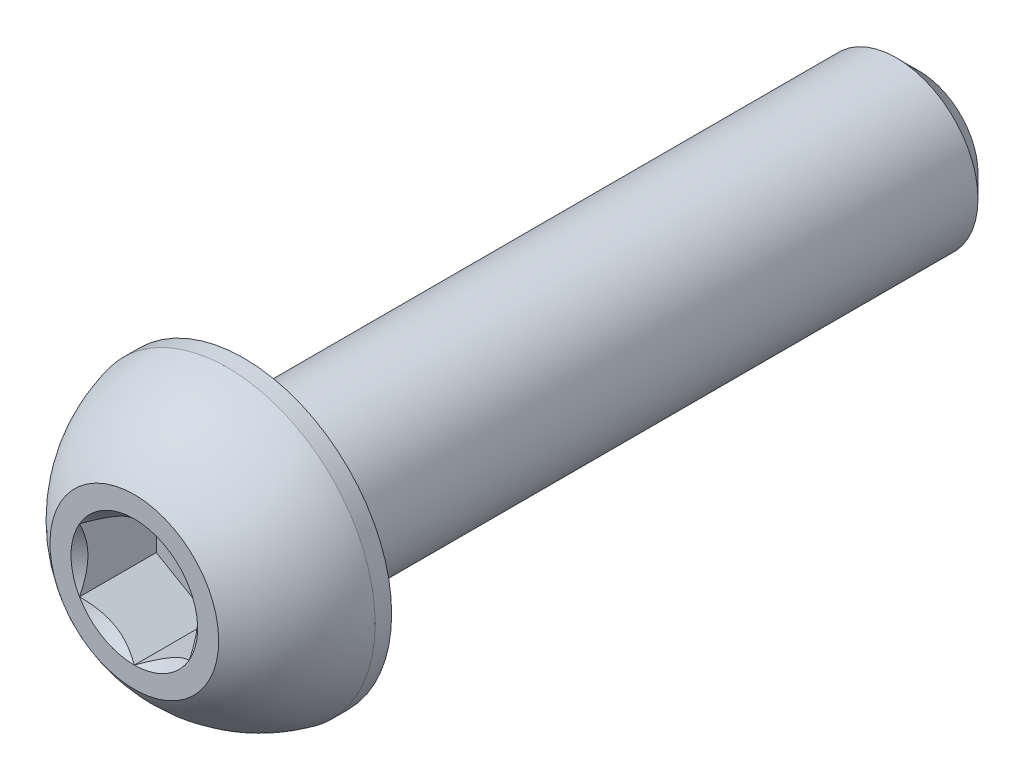
ISO-10303-21;
HEADER;
FILE_DESCRIPTION(('STEP AP214'),'2;1');
FILE_NAME('part.step','',(''),(''),'','','');
FILE_SCHEMA(('AUTOMOTIVE_DESIGN { 1 0 10303 214 1 1 1 1 }'));
ENDSEC;
DATA;
#1=APPLICATION_CONTEXT('core data for automotive mechanical design processes');
#2=APPLICATION_PROTOCOL_DEFINITION('international standard','automotive_design',2000,#1);
#3=PRODUCT_CONTEXT('',#1,'mechanical');
#4=PRODUCT('Part','Part','',(#3));
#5=PRODUCT_RELATED_PRODUCT_CATEGORY('part','',(#4));
#6=PRODUCT_DEFINITION_FORMATION('','',#4);
#7=PRODUCT_DEFINITION_CONTEXT('part definition',#1,'design');
#8=PRODUCT_DEFINITION('design','',#6,#7);
#9=PRODUCT_DEFINITION_SHAPE('','',#8);
#10=(LENGTH_UNIT() NAMED_UNIT(*) SI_UNIT(.MILLI.,.METRE.));
#11=(NAMED_UNIT(*) PLANE_ANGLE_UNIT() SI_UNIT($,.RADIAN.));
#12=(NAMED_UNIT(*) SI_UNIT($,.STERADIAN.) SOLID_ANGLE_UNIT());
#13=UNCERTAINTY_MEASURE_WITH_UNIT(LENGTH_MEASURE(1.E-05),#10,'distance_accuracy_value','');
#14=(GEOMETRIC_REPRESENTATION_CONTEXT(3) GLOBAL_UNCERTAINTY_ASSIGNED_CONTEXT((#13)) GLOBAL_UNIT_ASSIGNED_CONTEXT((#10,
#11,#12)) REPRESENTATION_CONTEXT('',''));
#15=CARTESIAN_POINT('',(0.,0.,0.));
#16=DIRECTION('',(0.,0.,1.));
#17=DIRECTION('',(1.,0.,0.));
#18=AXIS2_PLACEMENT_3D('',#15,#16,#17);
#19=CARTESIAN_POINT('',(0.650000000000001,-0.375277674973256,-0.91));
#20=DIRECTION('',(0.,0.,1.));
#21=DIRECTION('',(1.,0.,0.));
#22=AXIS2_PLACEMENT_3D('',#19,#20,#21);
#23=PLANE('',#22);
#24=DIRECTION('',(0.,1.,0.));
#25=VECTOR('',#24,1.);
#26=CARTESIAN_POINT('',(-0.650000000000001,0.375277674973256,-0.91));
#27=LINE('',#26,#25);
#28=CARTESIAN_POINT('',(-0.650000000000001,0.375277674973256,-0.91));
#29=VERTEX_POINT('',#28);
#30=CARTESIAN_POINT('',(-0.650000000000001,-0.375277674973256,-0.91));
#31=VERTEX_POINT('',#30);
#32=EDGE_CURVE('E67',#29,#31,#27,.F.);
#33=ORIENTED_EDGE('',*,*,#32,.T.);
#34=DIRECTION('',(0.866025403784439,-0.5,0.));
#35=VECTOR('',#34,1.);
#36=CARTESIAN_POINT('',(-0.650000000000001,-0.375277674973256,-0.91));
#37=LINE('',#36,#35);
#38=CARTESIAN_POINT('',(0.,-0.750555349946514,-0.91));
#39=VERTEX_POINT('',#38);
#40=EDGE_CURVE('E81',#31,#39,#37,.T.);
#41=ORIENTED_EDGE('',*,*,#40,.T.);
#42=DIRECTION('',(0.866025403784438,0.5,0.));
#43=VECTOR('',#42,1.);
#44=CARTESIAN_POINT('',(0.,-0.750555349946514,-0.91));
#45=LINE('',#44,#43);
#46=CARTESIAN_POINT('',(0.650000000000001,-0.375277674973256,-0.91));
#47=VERTEX_POINT('',#46);
#48=EDGE_CURVE('E84',#39,#47,#45,.T.);
#49=ORIENTED_EDGE('',*,*,#48,.T.);
#50=DIRECTION('',(0.,1.,0.));
#51=VECTOR('',#50,1.);
#52=CARTESIAN_POINT('',(0.650000000000001,-0.375277674973256,-0.91));
#53=LINE('',#52,#51);
#54=CARTESIAN_POINT('',(0.650000000000001,0.375277674973256,-0.91));
#55=VERTEX_POINT('',#54);
#56=EDGE_CURVE('E93',#47,#55,#53,.T.);
#57=ORIENTED_EDGE('',*,*,#56,.T.);
#58=DIRECTION('',(-0.866025403784439,0.5,0.));
#59=VECTOR('',#58,1.);
#60=CARTESIAN_POINT('',(0.650000000000001,0.375277674973256,-0.91));
#61=LINE('',#60,#59);
#62=CARTESIAN_POINT('',(0.,0.750555349946514,-0.91));
#63=VERTEX_POINT('',#62);
#64=EDGE_CURVE('E263',#55,#63,#61,.T.);
#65=ORIENTED_EDGE('',*,*,#64,.T.);
#66=DIRECTION('',(-0.866025403784439,-0.5,0.));
#67=VECTOR('',#66,1.);
#68=CARTESIAN_POINT('',(0.,0.750555349946514,-0.91));
#69=LINE('',#68,#67);
#70=EDGE_CURVE('E72',#63,#29,#69,.T.);
#71=ORIENTED_EDGE('',*,*,#70,.T.);
#72=EDGE_LOOP('',(#33,#41,#49,#57,#65,#71));
#73=FACE_BOUND('',#72,.T.);
#74=ADVANCED_FACE('F17',(#73),#23,.T.);
#75=CARTESIAN_POINT('',(-0.650000000000001,-0.375277674973256,-0.91));
#76=DIRECTION('',(-0.5,-0.866025403784439,0.));
#77=DIRECTION('',(0.866025403784439,-0.5,0.));
#78=AXIS2_PLACEMENT_3D('',#75,#76,#77);
#79=PLANE('',#78);
#80=CARTESIAN_POINT('',(-0.650000000003106,-0.375277674971463,-4.41290134901671E-12));
#81=CARTESIAN_POINT('',(-0.627658187702417,-0.38817672631745,-0.0128852768620479));
#82=CARTESIAN_POINT('',(-0.604944327314008,-0.401290579727033,-0.0250148378455423));
#83=CARTESIAN_POINT('',(-0.558628424322748,-0.428031078786798,-0.0472236226126969));
#84=CARTESIAN_POINT('',(-0.535021979420529,-0.441660266105704,-0.0572904939612144));
#85=CARTESIAN_POINT('',(-0.48741772651719,-0.469144594334018,-0.0745327488497148));
#86=CARTESIAN_POINT('',(-0.463432082445054,-0.482992712395752,-0.0817515019129221));
#87=CARTESIAN_POINT('',(-0.414944739657003,-0.510986892806723,-0.0928821716789931));
#88=CARTESIAN_POINT('',(-0.39044449165135,-0.525132117587999,-0.0968023651586737));
#89=CARTESIAN_POINT('',(-0.330580650036921,-0.559694522658815,-0.101776896993975));
#90=CARTESIAN_POINT('',(-0.295077141699638,-0.580192482754522,-0.100873323609411));
#91=CARTESIAN_POINT('',(-0.224814729639984,-0.620758505271075,-0.0915850975613979));
#92=CARTESIAN_POINT('',(-0.190057015060289,-0.640825881140078,-0.0831892925293545));
#93=CARTESIAN_POINT('',(-0.129055083802418,-0.676045362572897,-0.0629573906715305));
#94=CARTESIAN_POINT('',(-0.102528811277548,-0.691360313155728,-0.0521824020198646));
#95=CARTESIAN_POINT('',(-0.050514302718005,-0.721390903674346,-0.0279117157399621));
#96=CARTESIAN_POINT('',(-0.0250230041639314,-0.736108311756534,-0.0144248746778537));
#97=CARTESIAN_POINT('',(3.1059329908606E-12,-0.750555349948306,-4.41360538714369E-12));
#98=B_SPLINE_CURVE_WITH_KNOTS('',3,(#80,#81,#82,#83,#84,#85,#86,#87,#88,#89,#90,#91,#92,#93,#94,
#95,#96,#97),.UNSPECIFIED.,.F.,.F.,(4,2,2,2,2,2,2,2,4),(0.,0.086568915278292,0.173642001954796,
0.259332662432136,0.34480766041021,0.467047188351969,0.589468976870045,0.686740705134744,
0.783699770545585),.UNSPECIFIED.);
#99=CARTESIAN_POINT('',(-0.650000000002688,-0.375277674974807,-3.10290154336415E-12));
#100=VERTEX_POINT('',#99);
#101=CARTESIAN_POINT('',(-3.82135894395069E-12,-0.750555349950513,-2.20681226923395E-12));
#102=VERTEX_POINT('',#101);
#103=EDGE_CURVE('E20',#100,#102,#98,.T.);
#104=ORIENTED_EDGE('',*,*,#103,.T.);
#105=DIRECTION('',(0.,0.,1.));
#106=VECTOR('',#105,1.);
#107=CARTESIAN_POINT('',(0.,-0.750555349946514,-0.91));
#108=LINE('',#107,#106);
#109=EDGE_CURVE('E88',#102,#39,#108,.F.);
#110=ORIENTED_EDGE('',*,*,#109,.T.);
#111=ORIENTED_EDGE('',*,*,#40,.F.);
#112=DIRECTION('',(0.,0.,1.));
#113=VECTOR('',#112,1.);
#114=CARTESIAN_POINT('',(-0.650000000000001,-0.375277674973256,-0.91));
#115=LINE('',#114,#113);
#116=EDGE_CURVE('E59',#31,#100,#115,.T.);
#117=ORIENTED_EDGE('',*,*,#116,.T.);
#118=EDGE_LOOP('',(#104,#110,#111,#117));
#119=FACE_BOUND('',#118,.T.);
#120=ADVANCED_FACE('F89',(#119),#79,.F.);
#121=CARTESIAN_POINT('',(0.,-0.750555349946514,-0.91));
#122=DIRECTION('',(0.5,-0.866025403784438,0.));
#123=DIRECTION('',(0.866025403784438,0.5,0.));
#124=AXIS2_PLACEMENT_3D('',#121,#122,#123);
#125=PLANE('',#124);
#126=CARTESIAN_POINT('',(-3.10513434680188E-12,-0.750555349948307,-4.41302114699376E-12));
#127=CARTESIAN_POINT('',(0.0223418122975842,-0.737656298602319,-0.012885276862048));
#128=CARTESIAN_POINT('',(0.0450556726859926,-0.724542445192736,-0.0250148378455423));
#129=CARTESIAN_POINT('',(0.0913715756772533,-0.697801946132971,-0.0472236226126967));
#130=CARTESIAN_POINT('',(0.114978020579472,-0.684172758814065,-0.0572904939612141));
#131=CARTESIAN_POINT('',(0.162582273482811,-0.656688430585752,-0.0745327488497144));
#132=CARTESIAN_POINT('',(0.186567917554947,-0.642840312524017,-0.0817515019129215));
#133=CARTESIAN_POINT('',(0.235055260342998,-0.614846132113047,-0.0928821716789924));
#134=CARTESIAN_POINT('',(0.25955550834865,-0.60070090733177,-0.0968023651586729));
#135=CARTESIAN_POINT('',(0.319419349963079,-0.566138502260955,-0.101776896993974));
#136=CARTESIAN_POINT('',(0.354922858300362,-0.545640542165248,-0.100873323609411));
#137=CARTESIAN_POINT('',(0.425185270360016,-0.505074519648694,-0.0915850975613972));
#138=CARTESIAN_POINT('',(0.459942984939711,-0.485007143779691,-0.0831892925293537));
#139=CARTESIAN_POINT('',(0.520944916197582,-0.449787662346872,-0.0629573906715296));
#140=CARTESIAN_POINT('',(0.547471188722452,-0.434472711764042,-0.0521824020198637));
#141=CARTESIAN_POINT('',(0.599485697281995,-0.404442121245423,-0.0279117157399613));
#142=CARTESIAN_POINT('',(0.624976995836069,-0.389724713163235,-0.0144248746778528));
#143=CARTESIAN_POINT('',(0.650000000003106,-0.375277674971463,-4.41266400623362E-12));
#144=B_SPLINE_CURVE_WITH_KNOTS('',3,(#126,#127,#128,#129,#130,#131,#132,#133,#134,#135,#136,
#137,#138,#139,#140,#141,#142,#143),.UNSPECIFIED.,.F.,.F.,(4,2,2,2,2,2,2,2,4),(0.,
0.0865689152782918,0.173642001954795,0.259332662432135,0.344807660410208,0.467047188351967,
0.589468976870044,0.686740705134743,0.783699770545584),.UNSPECIFIED.);
#145=CARTESIAN_POINT('',(0.650000000001554,-0.375277674978565,-2.20630106907732E-12));
#146=VERTEX_POINT('',#145);
#147=EDGE_CURVE('E202',#102,#146,#144,.T.);
#148=ORIENTED_EDGE('',*,*,#147,.T.);
#149=DIRECTION('',(0.,0.,-1.));
#150=VECTOR('',#149,1.);
#151=CARTESIAN_POINT('',(0.650000000000001,-0.375277674973256,-0.91));
#152=LINE('',#151,#150);
#153=EDGE_CURVE('E97',#146,#47,#152,.T.);
#154=ORIENTED_EDGE('',*,*,#153,.T.);
#155=ORIENTED_EDGE('',*,*,#48,.F.);
#156=ORIENTED_EDGE('',*,*,#109,.F.);
#157=EDGE_LOOP('',(#148,#154,#155,#156));
#158=FACE_BOUND('',#157,.T.);
#159=ADVANCED_FACE('F95',(#158),#125,.F.);
#160=CARTESIAN_POINT('',(0.650000000000001,-0.375277674973256,-0.91));
#161=DIRECTION('',(1.,0.,0.));
#162=DIRECTION('',(0.,0.,-1.));
#163=AXIS2_PLACEMENT_3D('',#160,#161,#162);
#164=PLANE('',#163);
#165=CARTESIAN_POINT('',(0.650000000000001,-0.375277674976841,-4.4129866438153E-12));
#166=CARTESIAN_POINT('',(0.650000000000001,-0.349479572297389,-0.0128852768630225));
#167=CARTESIAN_POINT('',(0.650000000000001,-0.32325186549082,-0.0250148378480049));
#168=CARTESIAN_POINT('',(0.650000000000001,-0.269770867396475,-0.047223622619523));
#169=CARTESIAN_POINT('',(0.650000000000001,-0.242512492771248,-0.0572904939709195));
#170=CARTESIAN_POINT('',(0.650000000000001,-0.187543836339123,-0.0745327488668831));
#171=CARTESIAN_POINT('',(0.650000000000001,-0.159847600227568,-0.0817515019346237));
#172=CARTESIAN_POINT('',(0.650000000000001,-0.103859239428849,-0.0928821717113189));
#173=CARTESIAN_POINT('',(0.650000000000001,-0.0755687898776079,-0.0968023651970885));
#174=CARTESIAN_POINT('',(0.650000000000001,-0.006443979777503,-0.101776897047502));
#175=CARTESIAN_POINT('',(0.650000000000001,0.0345519403839369,-0.100873323675418));
#176=CARTESIAN_POINT('',(0.650000000000001,0.115683985359937,-0.0915850976572371));
#177=CARTESIAN_POINT('',(0.650000000000001,0.155818737070815,-0.0831892926425625));
#178=CARTESIAN_POINT('',(0.650000000000001,0.226257699967498,-0.0629573907945614));
#179=CARTESIAN_POINT('',(0.650000000000001,0.256887601188171,-0.0521824021260602));
#180=CARTESIAN_POINT('',(0.650000000000001,0.316948782330806,-0.027911715800576));
#181=CARTESIAN_POINT('',(0.650000000000001,0.346383598545568,-0.014424874709727));
#182=CARTESIAN_POINT('',(0.650000000000001,0.375277674976841,-4.41309680496693E-12));
#183=B_SPLINE_CURVE_WITH_KNOTS('',3,(#165,#166,#167,#168,#169,#170,#171,#172,#173,#174,#175,
#176,#177,#178,#179,#180,#181,#182),.UNSPECIFIED.,.F.,.F.,(4,2,2,2,2,2,2,2,4),(0.,
0.0865689152459494,0.173642001890102,0.259332662336391,0.344807660283437,0.467047188135298,
0.589468976563184,0.686740704999196,0.783699770581928),.UNSPECIFIED.);
#184=CARTESIAN_POINT('',(0.650000000005375,0.375277674971945,-2.20651526969784E-12));
#185=VERTEX_POINT('',#184);
#186=EDGE_CURVE('E184',#146,#185,#183,.T.);
#187=ORIENTED_EDGE('',*,*,#186,.T.);
#188=DIRECTION('',(0.,0.,1.));
#189=VECTOR('',#188,1.);
#190=CARTESIAN_POINT('',(0.650000000000001,0.375277674973256,-0.91));
#191=LINE('',#190,#189);
#192=EDGE_CURVE('E260',#185,#55,#191,.F.);
#193=ORIENTED_EDGE('',*,*,#192,.T.);
#194=ORIENTED_EDGE('',*,*,#56,.F.);
#195=ORIENTED_EDGE('',*,*,#153,.F.);
#196=EDGE_LOOP('',(#187,#193,#194,#195));
#197=FACE_BOUND('',#196,.T.);
#198=ADVANCED_FACE('F174',(#197),#164,.F.);
#199=CARTESIAN_POINT('',(0.650000000000001,0.375277674973256,-0.91));
#200=DIRECTION('',(0.5,0.866025403784439,0.));
#201=DIRECTION('',(-0.866025403784439,0.5,0.));
#202=AXIS2_PLACEMENT_3D('',#199,#200,#201);
#203=PLANE('',#202);
#204=CARTESIAN_POINT('',(0.650000000003106,0.375277674971463,-4.41299389541244E-12));
#205=CARTESIAN_POINT('',(0.627658187702417,0.38817672631745,-0.012885276862048));
#206=CARTESIAN_POINT('',(0.604944327314008,0.401290579727033,-0.0250148378455423));
#207=CARTESIAN_POINT('',(0.558628424322747,0.428031078786798,-0.047223622612697));
#208=CARTESIAN_POINT('',(0.535021979420529,0.441660266105704,-0.0572904939612145));
#209=CARTESIAN_POINT('',(0.487417726517189,0.469144594334018,-0.0745327488497149));
#210=CARTESIAN_POINT('',(0.463432082445053,0.482992712395752,-0.0817515019129221));
#211=CARTESIAN_POINT('',(0.414944739657002,0.510986892806723,-0.0928821716789931));
#212=CARTESIAN_POINT('',(0.390444491651349,0.525132117588,-0.0968023651586737));
#213=CARTESIAN_POINT('',(0.33058065003692,0.559694522658815,-0.101776896993975));
#214=CARTESIAN_POINT('',(0.295077141699637,0.580192482754522,-0.100873323609411));
#215=CARTESIAN_POINT('',(0.224814729639983,0.620758505271075,-0.0915850975613977));
#216=CARTESIAN_POINT('',(0.190057015060288,0.640825881140079,-0.0831892925293544));
#217=CARTESIAN_POINT('',(0.129055083802417,0.676045362572897,-0.0629573906715303));
#218=CARTESIAN_POINT('',(0.102528811277548,0.691360313155728,-0.0521824020198643));
#219=CARTESIAN_POINT('',(0.0505143027180048,0.721390903674346,-0.0279117157399618));
#220=CARTESIAN_POINT('',(0.0250230041639313,0.736108311756534,-0.0144248746778534));
#221=CARTESIAN_POINT('',(-3.10605534729751E-12,0.750555349948306,-4.41357997323327E-12));
#222=B_SPLINE_CURVE_WITH_KNOTS('',3,(#204,#205,#206,#207,#208,#209,#210,#211,#212,#213,#214,
#215,#216,#217,#218,#219,#220,#221),.UNSPECIFIED.,.F.,.F.,(4,2,2,2,2,2,2,2,4),(0.,
0.0865689152782922,0.173642001954796,0.259332662432137,0.34480766041021,0.467047188351969,
0.589468976870046,0.686740705134744,0.783699770545585),.UNSPECIFIED.);
#223=CARTESIAN_POINT('',(3.82133084754313E-12,0.750555349950513,-2.20676269446314E-12));
#224=VERTEX_POINT('',#223);
#225=EDGE_CURVE('E178',#185,#224,#222,.T.);
#226=ORIENTED_EDGE('',*,*,#225,.T.);
#227=DIRECTION('',(0.,0.,1.));
#228=VECTOR('',#227,1.);
#229=CARTESIAN_POINT('',(0.,0.750555349946514,-0.91));
#230=LINE('',#229,#228);
#231=EDGE_CURVE('E255',#224,#63,#230,.F.);
#232=ORIENTED_EDGE('',*,*,#231,.T.);
#233=ORIENTED_EDGE('',*,*,#64,.F.);
#234=ORIENTED_EDGE('',*,*,#192,.F.);
#235=EDGE_LOOP('',(#226,#232,#233,#234));
#236=FACE_BOUND('',#235,.T.);
#237=ADVANCED_FACE('F170',(#236),#203,.F.);
#238=CARTESIAN_POINT('',(0.,0.750555349946514,-0.91));
#239=DIRECTION('',(-0.5,0.866025403784439,0.));
#240=DIRECTION('',(-0.866025403784439,-0.5,0.));
#241=AXIS2_PLACEMENT_3D('',#238,#239,#240);
#242=PLANE('',#241);
#243=CARTESIAN_POINT('',(3.10493996163853E-12,0.750555349948307,-4.41306487472797E-12));
#244=CARTESIAN_POINT('',(-0.0223418122975843,0.73765629860232,-0.012885276862048));
#245=CARTESIAN_POINT('',(-0.0450556726859927,0.724542445192736,-0.0250148378455423));
#246=CARTESIAN_POINT('',(-0.0913715756772534,0.697801946132971,-0.0472236226126966));
#247=CARTESIAN_POINT('',(-0.114978020579472,0.684172758814065,-0.0572904939612139));
#248=CARTESIAN_POINT('',(-0.162582273482811,0.656688430585752,-0.0745327488497141));
#249=CARTESIAN_POINT('',(-0.186567917554947,0.642840312524018,-0.0817515019129213));
#250=CARTESIAN_POINT('',(-0.235055260342997,0.614846132113047,-0.0928821716789922));
#251=CARTESIAN_POINT('',(-0.25955550834865,0.600700907331771,-0.0968023651586728));
#252=CARTESIAN_POINT('',(-0.319419349963079,0.566138502260955,-0.101776896993974));
#253=CARTESIAN_POINT('',(-0.354922858300362,0.545640542165248,-0.10087332360941));
#254=CARTESIAN_POINT('',(-0.425185270360016,0.505074519648695,-0.0915850975613969));
#255=CARTESIAN_POINT('',(-0.459942984939711,0.485007143779692,-0.0831892925293534));
#256=CARTESIAN_POINT('',(-0.520944916197582,0.449787662346873,-0.0629573906715294));
#257=CARTESIAN_POINT('',(-0.547471188722452,0.434472711764042,-0.0521824020198635));
#258=CARTESIAN_POINT('',(-0.599485697281995,0.404442121245423,-0.027911715739961));
#259=CARTESIAN_POINT('',(-0.624976995836069,0.389724713163236,-0.0144248746778525));
#260=CARTESIAN_POINT('',(-0.650000000003106,0.375277674971464,-4.41234683703336E-12));
#261=B_SPLINE_CURVE_WITH_KNOTS('',3,(#243,#244,#245,#246,#247,#248,#249,#250,#251,#252,#253,
#254,#255,#256,#257,#258,#259,#260),.UNSPECIFIED.,.F.,.F.,(4,2,2,2,2,2,2,2,4),(0.,
0.0865689152782916,0.173642001954795,0.259332662432135,0.344807660410208,0.467047188351967,
0.589468976870043,0.686740705134742,0.783699770545583),.UNSPECIFIED.);
#262=CARTESIAN_POINT('',(-0.650000000001554,0.375277674978566,-2.20610640845908E-12));
#263=VERTEX_POINT('',#262);
#264=EDGE_CURVE('E40',#224,#263,#261,.T.);
#265=ORIENTED_EDGE('',*,*,#264,.T.);
#266=DIRECTION('',(0.,0.,1.));
#267=VECTOR('',#266,1.);
#268=CARTESIAN_POINT('',(-0.650000000000001,0.375277674973256,-0.91));
#269=LINE('',#268,#267);
#270=EDGE_CURVE('E248',#263,#29,#269,.F.);
#271=ORIENTED_EDGE('',*,*,#270,.T.);
#272=ORIENTED_EDGE('',*,*,#70,.F.);
#273=ORIENTED_EDGE('',*,*,#231,.F.);
#274=EDGE_LOOP('',(#265,#271,#272,#273));
#275=FACE_BOUND('',#274,.T.);
#276=ADVANCED_FACE('F163',(#275),#242,.F.);
#277=CARTESIAN_POINT('',(-0.650000000000001,0.375277674973256,-0.91));
#278=DIRECTION('',(-1.,0.,0.));
#279=DIRECTION('',(0.,0.,1.));
#280=AXIS2_PLACEMENT_3D('',#277,#278,#279);
#281=PLANE('',#280);
#282=CARTESIAN_POINT('',(-0.650000000000001,0.375277674976841,-4.41298182513897E-12));
#283=CARTESIAN_POINT('',(-0.650000000000001,0.349479572297389,-0.0128852768630225));
#284=CARTESIAN_POINT('',(-0.650000000000001,0.32325186549082,-0.0250148378480049));
#285=CARTESIAN_POINT('',(-0.650000000000001,0.269770867396475,-0.047223622619523));
#286=CARTESIAN_POINT('',(-0.650000000000001,0.242512492771248,-0.0572904939709195));
#287=CARTESIAN_POINT('',(-0.650000000000001,0.187543836339123,-0.0745327488668831));
#288=CARTESIAN_POINT('',(-0.650000000000001,0.159847600227568,-0.0817515019346237));
#289=CARTESIAN_POINT('',(-0.650000000000001,0.103859239428849,-0.0928821717113189));
#290=CARTESIAN_POINT('',(-0.650000000000001,0.075568789877608,-0.0968023651970885));
#291=CARTESIAN_POINT('',(-0.650000000000001,0.00644397977750309,-0.101776897047502));
#292=CARTESIAN_POINT('',(-0.650000000000001,-0.0345519403839369,-0.100873323675418));
#293=CARTESIAN_POINT('',(-0.650000000000001,-0.115683985359937,-0.0915850976572371));
#294=CARTESIAN_POINT('',(-0.650000000000001,-0.155818737070815,-0.0831892926425626));
#295=CARTESIAN_POINT('',(-0.650000000000001,-0.226257699967498,-0.0629573907945614));
#296=CARTESIAN_POINT('',(-0.650000000000001,-0.256887601188171,-0.0521824021260602));
#297=CARTESIAN_POINT('',(-0.650000000000001,-0.316948782330805,-0.027911715800576));
#298=CARTESIAN_POINT('',(-0.650000000000001,-0.346383598545568,-0.014424874709727));
#299=CARTESIAN_POINT('',(-0.650000000000001,-0.375277674976841,-4.41309680496692E-12));
#300=B_SPLINE_CURVE_WITH_KNOTS('',3,(#282,#283,#284,#285,#286,#287,#288,#289,#290,#291,#292,
#293,#294,#295,#296,#297,#298,#299),.UNSPECIFIED.,.F.,.F.,(4,2,2,2,2,2,2,2,4),(0.,
0.0865689152459495,0.173642001890102,0.259332662336391,0.344807660283437,0.467047188135298,
0.589468976563184,0.686740704999196,0.783699770581928),.UNSPECIFIED.);
#301=EDGE_CURVE('E143',#263,#100,#300,.T.);
#302=ORIENTED_EDGE('',*,*,#301,.T.);
#303=ORIENTED_EDGE('',*,*,#116,.F.);
#304=ORIENTED_EDGE('',*,*,#32,.F.);
#305=ORIENTED_EDGE('',*,*,#270,.F.);
#306=EDGE_LOOP('',(#302,#303,#304,#305));
#307=FACE_BOUND('',#306,.T.);
#308=ADVANCED_FACE('F159',(#307),#281,.F.);
#309=CARTESIAN_POINT('',(0.,0.,5.6843418860808E-11));
#310=DIRECTION('',(0.,0.,1.));
#311=DIRECTION('',(1.,0.,0.));
#312=AXIS2_PLACEMENT_3D('',#309,#310,#311);
#313=CONICAL_SURFACE('',#312,0.750555350009563,0.785398163397448);
#314=ORIENTED_EDGE('',*,*,#103,.F.);
#315=CARTESIAN_POINT('',(0.,0.,0.));
#316=DIRECTION('',(0.,0.,1.));
#317=DIRECTION('',(1.,0.,0.));
#318=AXIS2_PLACEMENT_3D('',#315,#316,#317);
#319=CIRCLE('',#318,0.75055534995272);
#320=EDGE_CURVE('E151',#100,#102,#319,.T.);
#321=ORIENTED_EDGE('',*,*,#320,.T.);
#322=EDGE_LOOP('',(#314,#321));
#323=FACE_BOUND('',#322,.T.);
#324=ADVANCED_FACE('F162',(#323),#313,.F.);
#325=CARTESIAN_POINT('',(0.,0.,5.6843418860808E-11));
#326=DIRECTION('',(0.,0.,1.));
#327=DIRECTION('',(1.,0.,0.));
#328=AXIS2_PLACEMENT_3D('',#325,#326,#327);
#329=CONICAL_SURFACE('',#328,0.750555350009563,0.785398163397448);
#330=ORIENTED_EDGE('',*,*,#147,.F.);
#331=CARTESIAN_POINT('',(0.,0.,0.));
#332=DIRECTION('',(0.,0.,1.));
#333=DIRECTION('',(1.,0.,0.));
#334=AXIS2_PLACEMENT_3D('',#331,#332,#333);
#335=CIRCLE('',#334,0.75055534995272);
#336=EDGE_CURVE('E301',#102,#146,#335,.T.);
#337=ORIENTED_EDGE('',*,*,#336,.T.);
#338=EDGE_LOOP('',(#330,#337));
#339=FACE_BOUND('',#338,.T.);
#340=ADVANCED_FACE('F197',(#339),#329,.F.);
#341=CARTESIAN_POINT('',(0.,0.,5.6843418860808E-11));
#342=DIRECTION('',(0.,0.,1.));
#343=DIRECTION('',(1.,0.,0.));
#344=AXIS2_PLACEMENT_3D('',#341,#342,#343);
#345=CONICAL_SURFACE('',#344,0.750555350009563,0.785398163116487);
#346=CARTESIAN_POINT('',(0.,0.,0.));
#347=DIRECTION('',(0.,0.,1.));
#348=DIRECTION('',(1.,0.,0.));
#349=AXIS2_PLACEMENT_3D('',#346,#347,#348);
#350=CIRCLE('',#349,0.75055534995272);
#351=EDGE_CURVE('E302',#146,#185,#350,.T.);
#352=ORIENTED_EDGE('',*,*,#351,.T.);
#353=ORIENTED_EDGE('',*,*,#186,.F.);
#354=EDGE_LOOP('',(#352,#353));
#355=FACE_BOUND('',#354,.T.);
#356=ADVANCED_FACE('F193',(#355),#345,.F.);
#357=CARTESIAN_POINT('',(0.,0.,5.6843418860808E-11));
#358=DIRECTION('',(0.,0.,1.));
#359=DIRECTION('',(1.,0.,0.));
#360=AXIS2_PLACEMENT_3D('',#357,#358,#359);
#361=CONICAL_SURFACE('',#360,0.750555350009563,0.785398163397448);
#362=ORIENTED_EDGE('',*,*,#225,.F.);
#363=CARTESIAN_POINT('',(0.,0.,0.));
#364=DIRECTION('',(0.,0.,1.));
#365=DIRECTION('',(1.,0.,0.));
#366=AXIS2_PLACEMENT_3D('',#363,#364,#365);
#367=CIRCLE('',#366,0.75055534995272);
#368=EDGE_CURVE('E303',#185,#224,#367,.T.);
#369=ORIENTED_EDGE('',*,*,#368,.T.);
#370=EDGE_LOOP('',(#362,#369));
#371=FACE_BOUND('',#370,.T.);
#372=ADVANCED_FACE('F190',(#371),#361,.F.);
#373=CARTESIAN_POINT('',(0.,0.,5.6843418860808E-11));
#374=DIRECTION('',(0.,0.,1.));
#375=DIRECTION('',(1.,0.,0.));
#376=AXIS2_PLACEMENT_3D('',#373,#374,#375);
#377=CONICAL_SURFACE('',#376,0.750555350009563,0.785398163397448);
#378=ORIENTED_EDGE('',*,*,#264,.F.);
#379=CARTESIAN_POINT('',(0.,0.,0.));
#380=DIRECTION('',(0.,0.,1.));
#381=DIRECTION('',(1.,0.,0.));
#382=AXIS2_PLACEMENT_3D('',#379,#380,#381);
#383=CIRCLE('',#382,0.75055534995272);
#384=EDGE_CURVE('E296',#224,#263,#383,.T.);
#385=ORIENTED_EDGE('',*,*,#384,.T.);
#386=EDGE_LOOP('',(#378,#385));
#387=FACE_BOUND('',#386,.T.);
#388=ADVANCED_FACE('F138',(#387),#377,.F.);
#389=CARTESIAN_POINT('',(0.,0.,5.6843418860808E-11));
#390=DIRECTION('',(0.,0.,1.));
#391=DIRECTION('',(1.,0.,0.));
#392=AXIS2_PLACEMENT_3D('',#389,#390,#391);
#393=CONICAL_SURFACE('',#392,0.750555350009563,0.785398163116487);
#394=ORIENTED_EDGE('',*,*,#301,.F.);
#395=CARTESIAN_POINT('',(0.,0.,0.));
#396=DIRECTION('',(0.,0.,1.));
#397=DIRECTION('',(1.,0.,0.));
#398=AXIS2_PLACEMENT_3D('',#395,#396,#397);
#399=CIRCLE('',#398,0.75055534995272);
#400=EDGE_CURVE('E123',#263,#100,#399,.T.);
#401=ORIENTED_EDGE('',*,*,#400,.T.);
#402=EDGE_LOOP('',(#394,#401));
#403=FACE_BOUND('',#402,.T.);
#404=ADVANCED_FACE('F133',(#403),#393,.F.);
#405=CARTESIAN_POINT('',(0.,-1.,0.));
#406=DIRECTION('',(0.,0.,-1.));
#407=DIRECTION('',(-1.,0.,0.));
#408=AXIS2_PLACEMENT_3D('',#405,#406,#407);
#409=PLANE('',#408);
#410=ORIENTED_EDGE('',*,*,#384,.F.);
#411=ORIENTED_EDGE('',*,*,#368,.F.);
#412=ORIENTED_EDGE('',*,*,#351,.F.);
#413=ORIENTED_EDGE('',*,*,#336,.F.);
#414=ORIENTED_EDGE('',*,*,#320,.F.);
#415=ORIENTED_EDGE('',*,*,#400,.F.);
#416=EDGE_LOOP('',(#410,#411,#412,#413,#414,#415));
#417=FACE_BOUND('',#416,.T.);
#418=CARTESIAN_POINT('',(0.,1.00000000000001,0.));
#419=CARTESIAN_POINT('',(-0.0561777969338403,0.999996162467683,0.));
#420=CARTESIAN_POINT('',(-0.112414155046123,0.995243835427589,-1.02918447098932E-13));
#421=CARTESIAN_POINT('',(-0.195516780584768,0.981105613204521,0.));
#422=CARTESIAN_POINT('',(-0.223031183899548,0.975216824921697,1.36895489626145E-13));
#423=CARTESIAN_POINT('',(-0.277493185797452,0.961139380755349,-1.37016382190566E-13));
#424=CARTESIAN_POINT('',(-0.304440262377073,0.952948698448576,-4.96672111873551E-13));
#425=CARTESIAN_POINT('',(-0.384033110352207,0.925025165538941,-8.39380721785129E-13));
#426=CARTESIAN_POINT('',(-0.435539560435248,0.90192216461077,0.));
#427=CARTESIAN_POINT('',(-0.533916964942819,0.847407434282324,0.));
#428=CARTESIAN_POINT('',(-0.580787829391264,0.815995543651097,-4.77705163251363E-13));
#429=CARTESIAN_POINT('',(-0.668596507700723,0.745746681668121,-5.71801159648929E-13));
#430=CARTESIAN_POINT('',(-0.709534495553881,0.706909928141161,0.));
#431=CARTESIAN_POINT('',(-0.784308982924152,0.622913993235548,0.));
#432=CARTESIAN_POINT('',(-0.818145203567326,0.57775456369254,-1.80637401469222E-13));
#433=CARTESIAN_POINT('',(-0.877755557618464,0.482396655814078,-2.53042793269029E-13));
#434=CARTESIAN_POINT('',(-0.903529841165379,0.432198271343018,0.));
#435=CARTESIAN_POINT('',(-0.94628480097801,0.328187018961648,0.));
#436=CARTESIAN_POINT('',(-0.963265494925873,0.274374158319574,0.));
#437=CARTESIAN_POINT('',(-0.987951527530027,0.164661297286517,0.));
#438=CARTESIAN_POINT('',(-0.995656848504117,0.108761292916898,0.));
#439=CARTESIAN_POINT('',(-1.00157329044895,-0.00353880455270257,0.));
#440=CARTESIAN_POINT('',(-0.999784428527256,-0.059938896751393,0.));
#441=CARTESIAN_POINT('',(-0.986763335437448,-0.171638264228245,0.));
#442=CARTESIAN_POINT('',(-0.975531100745569,-0.226937539095632,0.));
#443=CARTESIAN_POINT('',(-0.943942086909787,-0.334865524150048,0.));
#444=CARTESIAN_POINT('',(-0.923585298133942,-0.387494231517942,0.));
#445=CARTESIAN_POINT('',(-0.874325052556324,-0.488587026631831,0.));
#446=CARTESIAN_POINT('',(-0.84542159853582,-0.537051115733074,0.));
#447=CARTESIAN_POINT('',(-0.779888517497414,-0.628438921427291,0.));
#448=CARTESIAN_POINT('',(-0.74325889360681,-0.671362640262812,0.));
#449=CARTESIAN_POINT('',(-0.663313267250202,-0.750451256244994,0.));
#450=CARTESIAN_POINT('',(-0.619997263867885,-0.786616152465414,0.));
#451=CARTESIAN_POINT('',(-0.527908489953885,-0.851160505184495,0.));
#452=CARTESIAN_POINT('',(-0.479135718709093,-0.879539960665728,-2.10725348523279E-13));
#453=CARTESIAN_POINT('',(-0.377517931625108,-0.92770781519987,-1.3014781623117E-13));
#454=CARTESIAN_POINT('',(-0.324672915960271,-0.947496214620613,1.18796861338691E-13));
#455=CARTESIAN_POINT('',(-0.216410755335138,-0.977920223622686,-1.18796855986757E-13));
#456=CARTESIAN_POINT('',(-0.160993610490719,-0.988555833616359,-6.05335217747713E-13));
#457=CARTESIAN_POINT('',(-0.0491603190305027,-1.00037235159134,-5.3524546770706E-13));
#458=CARTESIAN_POINT('',(0.00725582758529403,-1.00155325957266,0.));
#459=CARTESIAN_POINT('',(0.119485636663917,-0.994426850859307,0.));
#460=CARTESIAN_POINT('',(0.175299299099601,-0.986119533737186,-6.20776098089306E-13));
#461=CARTESIAN_POINT('',(0.28473975373606,-0.960252493875586,-6.1608174018166E-13));
#462=CARTESIAN_POINT('',(0.338366545843202,-0.942692770739954,0.));
#463=CARTESIAN_POINT('',(0.4419109433375,-0.8988193904683,0.));
#464=CARTESIAN_POINT('',(0.491828549209383,-0.872505734476271,-5.68106077709223E-13));
#465=CARTESIAN_POINT('',(0.586537561610494,-0.811871459338195,-6.18444776409709E-13));
#466=CARTESIAN_POINT('',(0.631328968842213,-0.777550841289421,0.));
#467=CARTESIAN_POINT('',(0.714514112869046,-0.701876885708412,0.));
#468=CARTESIAN_POINT('',(0.752907847074589,-0.660523545329572,-2.63710368283483E-13));
#469=CARTESIAN_POINT('',(0.822207748826801,-0.571958040557957,-3.39973413765231E-13));
#470=CARTESIAN_POINT('',(0.853113913936857,-0.524745874258603,0.));
#471=CARTESIAN_POINT('',(0.906561296057355,-0.42580299630612,0.));
#472=CARTESIAN_POINT('',(0.92910252189787,-0.374072289422858,0.));
#473=CARTESIAN_POINT('',(0.965180189593774,-0.267560790261442,-1.27031864519422E-13));
#474=CARTESIAN_POINT('',(0.978716634809268,-0.212779999121426,0.));
#475=CARTESIAN_POINT('',(0.996400499385502,-0.101723269876318,0.));
#476=CARTESIAN_POINT('',(1.00054790182809,-0.045447329077295,0.));
#477=CARTESIAN_POINT('',(0.99933594424054,0.0670019627861678,0.));
#478=CARTESIAN_POINT('',(0.993976602333647,0.123175314045975,0.));
#479=CARTESIAN_POINT('',(0.973903139425232,0.233825136898811,0.));
#480=CARTESIAN_POINT('',(0.959188999613032,0.288301605079508,0.));
#481=CARTESIAN_POINT('',(0.920823881849961,0.394011787389806,0.));
#482=CARTESIAN_POINT('',(0.897172737458795,0.445245441105381,0.));
#483=CARTESIAN_POINT('',(0.841603801048328,0.543013709722105,0.));
#484=CARTESIAN_POINT('',(0.809686333608782,0.589548509025548,0.));
#485=CARTESIAN_POINT('',(0.738498023506805,0.676597294779332,0.));
#486=CARTESIAN_POINT('',(0.699226965171042,0.717111104577656,0.));
#487=CARTESIAN_POINT('',(0.614415026423815,0.790981968836673,0.));
#488=CARTESIAN_POINT('',(0.5688742676973,0.824339162163812,-1.43280734525072E-13));
#489=CARTESIAN_POINT('',(0.496874769950627,0.86828023023467,0.));
#490=CARTESIAN_POINT('',(0.472234522890903,0.881921727134843,0.));
#491=CARTESIAN_POINT('',(0.421917221888659,0.907070351448026,0.));
#492=CARTESIAN_POINT('',(0.396241101925867,0.918579351442331,0.));
#493=CARTESIAN_POINT('',(0.317928331225866,0.949773031000212,-1.14427570022484E-13));
#494=CARTESIAN_POINT('',(0.263926994707144,0.966173282224611,-5.36833267348323E-13));
#495=CARTESIAN_POINT('',(0.174660736143585,0.985256728215535,-3.72039672383659E-13));
#496=CARTESIAN_POINT('',(0.139965770385298,0.99077767513829,-1.04110623028663E-13));
#497=CARTESIAN_POINT('',(0.0701881591352166,0.998150510067786,1.04110623028732E-13));
#498=CARTESIAN_POINT('',(0.0351055136434215,1.00000239807452,0.));
#499=CARTESIAN_POINT('',(0.,1.00000000000001,0.));
#500=B_SPLINE_CURVE_WITH_KNOTS('',3,(#418,#419,#420,#421,#422,#423,#424,#425,#426,#427,#428,
#429,#430,#431,#432,#433,#434,#435,#436,#437,#438,#439,#440,#441,#442,#443,#444,#445,#446,#447,
#448,#449,#450,#451,#452,#453,#454,#455,#456,#457,#458,#459,#460,#461,#462,#463,#464,#465,#466,
#467,#468,#469,#470,#471,#472,#473,#474,#475,#476,#477,#478,#479,#480,#481,#482,#483,#484,#485,
#486,#487,#488,#489,#490,#491,#492,#493,#494,#495,#496,#497,#498,#499),.UNSPECIFIED.,.T.,.F.,(4,
2,2,2,2,2,2,2,2,2,2,2,2,2,2,2,2,2,2,2,2,2,2,2,2,2,2,2,2,2,2,2,2,2,2,2,2,2,2,2,4),(0.,
0.168383207623868,0.25271406517895,0.337119395411382,0.505602358879319,0.674088591937089,
0.842569882836515,1.01105778846337,1.17954255612185,1.34802698498987,1.51651173504935,
1.68499618151621,1.85348069085246,2.02196537804252,2.19045001040412,2.35893457456882,
2.52741916182291,2.69590377109513,2.8643883731535,3.03287296762145,3.20135756208929,
3.36984216414756,3.5383267734197,3.7068113606737,3.8752959248386,4.04378055720042,
4.21226524439062,4.380749753727,4.54923420019388,4.71771895025337,4.88620337912129,
5.05468814677968,5.22317605240634,5.39165734330552,5.56014357636356,5.72862653983171,
5.81303187006433,5.89736272761963,6.0657459352436,6.17096862668383,6.27619131812413),.UNSPECIFIED.);
#501=CARTESIAN_POINT('',(0.,1.00000000000001,0.));
#502=VERTEX_POINT('',#501);
#503=EDGE_CURVE('E115',#502,#502,#500,.F.);
#504=ORIENTED_EDGE('',*,*,#503,.F.);
#505=EDGE_LOOP('',(#504));
#506=FACE_BOUND('',#505,.T.);
#507=ADVANCED_FACE('F129',(#417,#506),#409,.F.);
#508=CARTESIAN_POINT('',(0.,0.,-1.48575791855203));
#509=DIRECTION('',(0.,-1.,0.));
#510=DIRECTION('',(0.,0.,-1.));
#511=AXIS2_PLACEMENT_3D('',#508,#509,#510);
#512=SPHERICAL_SURFACE('',#511,1.790942933915);
#513=ORIENTED_EDGE('',*,*,#503,.T.);
#514=EDGE_LOOP('',(#513));
#515=FACE_BOUND('',#514,.T.);
#516=CARTESIAN_POINT('',(0.,0.,-1.105));
#517=DIRECTION('',(0.,0.,1.));
#518=DIRECTION('',(1.,0.,0.));
#519=AXIS2_PLACEMENT_3D('',#516,#517,#518);
#520=CIRCLE('',#519,1.75);
#521=CARTESIAN_POINT('',(1.75,0.,-1.105));
#522=VERTEX_POINT('',#521);
#523=EDGE_CURVE('E112',#522,#522,#520,.F.);
#524=ORIENTED_EDGE('',*,*,#523,.F.);
#525=EDGE_LOOP('',(#524));
#526=FACE_BOUND('',#525,.T.);
#527=ADVANCED_FACE('F125',(#515,#526),#512,.T.);
#528=CARTESIAN_POINT('',(0.,-1.,-9.30000000000001));
#529=DIRECTION('',(0.,0.,-1.));
#530=DIRECTION('',(0.,1.,0.));
#531=AXIS2_PLACEMENT_3D('',#528,#529,#530);
#532=PLANE('',#531);
#533=CARTESIAN_POINT('',(0.,0.,-9.29999999999609));
#534=DIRECTION('',(0.,0.,1.));
#535=DIRECTION('',(1.,0.,0.));
#536=AXIS2_PLACEMENT_3D('',#533,#534,#535);
#537=CIRCLE('',#536,0.70000000005166);
#538=CARTESIAN_POINT('',(0.70000000005166,0.,-9.29999999999609));
#539=VERTEX_POINT('',#538);
#540=EDGE_CURVE('E109',#539,#539,#537,.T.);
#541=ORIENTED_EDGE('',*,*,#540,.F.);
#542=EDGE_LOOP('',(#541));
#543=FACE_BOUND('',#542,.T.);
#544=ADVANCED_FACE('F233',(#543),#532,.T.);
#545=CARTESIAN_POINT('',(0.,0.,0.));
#546=DIRECTION('',(0.,0.,1.));
#547=DIRECTION('',(1.,0.,0.));
#548=AXIS2_PLACEMENT_3D('',#545,#546,#547);
#549=CYLINDRICAL_SURFACE('',#548,1.75);
#550=CARTESIAN_POINT('',(0.,0.,-1.3));
#551=DIRECTION('',(0.,0.,1.));
#552=DIRECTION('',(1.,0.,0.));
#553=AXIS2_PLACEMENT_3D('',#550,#551,#552);
#554=CIRCLE('',#553,1.75);
#555=CARTESIAN_POINT('',(1.75,0.,-1.3));
#556=VERTEX_POINT('',#555);
#557=EDGE_CURVE('E106',#556,#556,#554,.T.);
#558=ORIENTED_EDGE('',*,*,#557,.T.);
#559=EDGE_LOOP('',(#558));
#560=FACE_BOUND('',#559,.T.);
#561=ORIENTED_EDGE('',*,*,#523,.T.);
#562=EDGE_LOOP('',(#561));
#563=FACE_BOUND('',#562,.T.);
#564=ADVANCED_FACE('F230',(#560,#563),#549,.T.);
#565=CARTESIAN_POINT('',(0.,0.,-9.03325000001587));
#566=DIRECTION('',(0.,0.,1.));
#567=DIRECTION('',(1.,0.,0.));
#568=AXIS2_PLACEMENT_3D('',#565,#566,#567);
#569=CONICAL_SURFACE('',#568,0.96675000003188,0.785398163397448);
#570=ORIENTED_EDGE('',*,*,#540,.T.);
#571=EDGE_LOOP('',(#570));
#572=FACE_BOUND('',#571,.T.);
#573=CARTESIAN_POINT('',(0.,0.,-9.03325000000001));
#574=DIRECTION('',(0.,0.,-1.));
#575=DIRECTION('',(0.,1.,0.));
#576=AXIS2_PLACEMENT_3D('',#573,#574,#575);
#577=CIRCLE('',#576,0.966749999999999);
#578=CARTESIAN_POINT('',(0.,0.966749999999999,-9.03325000000001));
#579=VERTEX_POINT('',#578);
#580=EDGE_CURVE('E31',#579,#579,#577,.F.);
#581=ORIENTED_EDGE('',*,*,#580,.F.);
#582=EDGE_LOOP('',(#581));
#583=FACE_BOUND('',#582,.T.);
#584=ADVANCED_FACE('F223',(#572,#583),#569,.T.);
#585=CARTESIAN_POINT('',(0.,-1.75,-1.3));
#586=DIRECTION('',(0.,0.,1.));
#587=DIRECTION('',(1.,0.,0.));
#588=AXIS2_PLACEMENT_3D('',#585,#586,#587);
#589=PLANE('',#588);
#590=CARTESIAN_POINT('',(0.,0.,-1.3));
#591=DIRECTION('',(0.,0.,-1.));
#592=DIRECTION('',(0.,1.,0.));
#593=AXIS2_PLACEMENT_3D('',#590,#591,#592);
#594=CIRCLE('',#593,0.966749999999999);
#595=CARTESIAN_POINT('',(0.,0.966749999999999,-1.3));
#596=VERTEX_POINT('',#595);
#597=EDGE_CURVE('E11',#596,#596,#594,.T.);
#598=ORIENTED_EDGE('',*,*,#597,.F.);
#599=EDGE_LOOP('',(#598));
#600=FACE_BOUND('',#599,.T.);
#601=ORIENTED_EDGE('',*,*,#557,.F.);
#602=EDGE_LOOP('',(#601));
#603=FACE_BOUND('',#602,.T.);
#604=ADVANCED_FACE('F217',(#600,#603),#589,.F.);
#605=CARTESIAN_POINT('',(0.,0.,-9.30000000000001));
#606=DIRECTION('',(0.,0.,-1.));
#607=DIRECTION('',(0.,1.,0.));
#608=AXIS2_PLACEMENT_3D('',#605,#606,#607);
#609=CYLINDRICAL_SURFACE('',#608,0.966749999999999);
#610=ORIENTED_EDGE('',*,*,#597,.T.);
#611=EDGE_LOOP('',(#610));
#612=FACE_BOUND('',#611,.T.);
#613=ORIENTED_EDGE('',*,*,#580,.T.);
#614=EDGE_LOOP('',(#613));
#615=FACE_BOUND('',#614,.T.);
#616=ADVANCED_FACE('F215',(#612,#615),#609,.T.);
#617=CLOSED_SHELL('',(#74,#120,#159,#198,#237,#276,#308,#324,#340,#356,#372,#388,#404,#507,#527,
#544,#564,#584,#604,#616));
#618=MANIFOLD_SOLID_BREP('B1',#617);
#619=ADVANCED_BREP_SHAPE_REPRESENTATION('',(#18,#618),#14);
#620=SHAPE_DEFINITION_REPRESENTATION(#9,#619);
ENDSEC;
END-ISO-10303-21;
